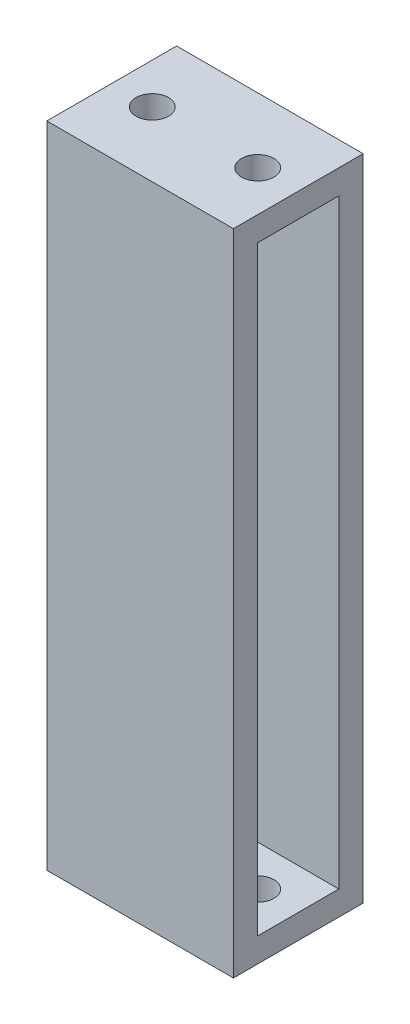
ISO-10303-21;
HEADER;
FILE_DESCRIPTION(('STEP AP214'),'2;1');
FILE_NAME('part.step','',(''),(''),'','','');
FILE_SCHEMA(('AUTOMOTIVE_DESIGN { 1 0 10303 214 1 1 1 1 }'));
ENDSEC;
DATA;
#1=APPLICATION_CONTEXT('core data for automotive mechanical design processes');
#2=APPLICATION_PROTOCOL_DEFINITION('international standard','automotive_design',2000,#1);
#3=PRODUCT_CONTEXT('',#1,'mechanical');
#4=PRODUCT('Part','Part','',(#3));
#5=PRODUCT_RELATED_PRODUCT_CATEGORY('part','',(#4));
#6=PRODUCT_DEFINITION_FORMATION('','',#4);
#7=PRODUCT_DEFINITION_CONTEXT('part definition',#1,'design');
#8=PRODUCT_DEFINITION('design','',#6,#7);
#9=PRODUCT_DEFINITION_SHAPE('','',#8);
#10=(LENGTH_UNIT() NAMED_UNIT(*) SI_UNIT(.MILLI.,.METRE.));
#11=(NAMED_UNIT(*) PLANE_ANGLE_UNIT() SI_UNIT($,.RADIAN.));
#12=(NAMED_UNIT(*) SI_UNIT($,.STERADIAN.) SOLID_ANGLE_UNIT());
#13=UNCERTAINTY_MEASURE_WITH_UNIT(LENGTH_MEASURE(1.E-05),#10,'distance_accuracy_value','');
#14=(GEOMETRIC_REPRESENTATION_CONTEXT(3) GLOBAL_UNCERTAINTY_ASSIGNED_CONTEXT((#13)) GLOBAL_UNIT_ASSIGNED_CONTEXT((#10,
#11,#12)) REPRESENTATION_CONTEXT('',''));
#15=CARTESIAN_POINT('',(0.,0.,0.));
#16=DIRECTION('',(0.,0.,1.));
#17=DIRECTION('',(1.,0.,0.));
#18=AXIS2_PLACEMENT_3D('',#15,#16,#17);
#19=CARTESIAN_POINT('',(1.5,80.,-5.));
#20=DIRECTION('',(-1.,0.,0.));
#21=DIRECTION('',(0.,0.,1.));
#22=AXIS2_PLACEMENT_3D('',#19,#20,#21);
#23=PLANE('',#22);
#24=DIRECTION('',(0.,0.,-1.));
#25=VECTOR('',#24,1.);
#26=CARTESIAN_POINT('',(1.5,77.,-5.));
#27=LINE('',#26,#25);
#28=CARTESIAN_POINT('',(1.49999999999999,77.,5.));
#29=VERTEX_POINT('',#28);
#30=CARTESIAN_POINT('',(1.5,77.,-5.));
#31=VERTEX_POINT('',#30);
#32=EDGE_CURVE('E228',#29,#31,#27,.T.);
#33=ORIENTED_EDGE('',*,*,#32,.F.);
#34=DIRECTION('',(0.,-1.,0.));
#35=VECTOR('',#34,1.);
#36=CARTESIAN_POINT('',(1.49999999999999,80.,5.));
#37=LINE('',#36,#35);
#38=CARTESIAN_POINT('',(1.49999999999999,3.,5.));
#39=VERTEX_POINT('',#38);
#40=EDGE_CURVE('E144',#29,#39,#37,.T.);
#41=ORIENTED_EDGE('',*,*,#40,.T.);
#42=DIRECTION('',(0.,0.,1.));
#43=VECTOR('',#42,1.);
#44=CARTESIAN_POINT('',(1.5,3.,-5.));
#45=LINE('',#44,#43);
#46=CARTESIAN_POINT('',(1.5,3.,-5.));
#47=VERTEX_POINT('',#46);
#48=EDGE_CURVE('E250',#47,#39,#45,.T.);
#49=ORIENTED_EDGE('',*,*,#48,.F.);
#50=DIRECTION('',(0.,-1.,0.));
#51=VECTOR('',#50,1.);
#52=CARTESIAN_POINT('',(1.5,80.,-5.));
#53=LINE('',#52,#51);
#54=EDGE_CURVE('E11',#31,#47,#53,.T.);
#55=ORIENTED_EDGE('',*,*,#54,.F.);
#56=EDGE_LOOP('',(#33,#41,#49,#55));
#57=FACE_BOUND('',#56,.T.);
#58=ADVANCED_FACE('F39',(#57),#23,.F.);
#59=CARTESIAN_POINT('',(1.5,80.,-5.));
#60=DIRECTION('',(0.,0.,-1.));
#61=DIRECTION('',(-1.,0.,0.));
#62=AXIS2_PLACEMENT_3D('',#59,#60,#61);
#63=PLANE('',#62);
#64=DIRECTION('',(-1.,0.,0.));
#65=VECTOR('',#64,1.);
#66=CARTESIAN_POINT('',(11.5,77.,-5.));
#67=LINE('',#66,#65);
#68=CARTESIAN_POINT('',(11.5,77.,-5.));
#69=VERTEX_POINT('',#68);
#70=EDGE_CURVE('E133',#69,#31,#67,.T.);
#71=ORIENTED_EDGE('',*,*,#70,.T.);
#72=ORIENTED_EDGE('',*,*,#54,.T.);
#73=DIRECTION('',(-1.,0.,0.));
#74=VECTOR('',#73,1.);
#75=CARTESIAN_POINT('',(11.5,3.,-5.));
#76=LINE('',#75,#74);
#77=CARTESIAN_POINT('',(11.5,3.,-5.));
#78=VERTEX_POINT('',#77);
#79=EDGE_CURVE('E242',#78,#47,#76,.T.);
#80=ORIENTED_EDGE('',*,*,#79,.F.);
#81=DIRECTION('',(0.,-1.,0.));
#82=VECTOR('',#81,1.);
#83=CARTESIAN_POINT('',(11.5,80.,-5.));
#84=LINE('',#83,#82);
#85=EDGE_CURVE('E48',#69,#78,#84,.T.);
#86=ORIENTED_EDGE('',*,*,#85,.F.);
#87=EDGE_LOOP('',(#71,#72,#80,#86));
#88=FACE_BOUND('',#87,.T.);
#89=ADVANCED_FACE('F311',(#88),#63,.F.);
#90=CARTESIAN_POINT('',(-1.5,80.,-5.));
#91=DIRECTION('',(0.,0.,-1.));
#92=DIRECTION('',(-1.,0.,0.));
#93=AXIS2_PLACEMENT_3D('',#90,#91,#92);
#94=PLANE('',#93);
#95=CARTESIAN_POINT('',(-1.5,77.,-5.));
#96=VERTEX_POINT('',#95);
#97=CARTESIAN_POINT('',(-11.5,77.,-5.));
#98=VERTEX_POINT('',#97);
#99=EDGE_CURVE('E136',#96,#98,#67,.T.);
#100=ORIENTED_EDGE('',*,*,#99,.T.);
#101=DIRECTION('',(0.,-1.,0.));
#102=VECTOR('',#101,1.);
#103=CARTESIAN_POINT('',(-11.5,80.,-5.));
#104=LINE('',#103,#102);
#105=CARTESIAN_POINT('',(-11.5,3.,-5.));
#106=VERTEX_POINT('',#105);
#107=EDGE_CURVE('E178',#98,#106,#104,.T.);
#108=ORIENTED_EDGE('',*,*,#107,.T.);
#109=CARTESIAN_POINT('',(-1.5,3.,-5.));
#110=VERTEX_POINT('',#109);
#111=EDGE_CURVE('E241',#110,#106,#76,.T.);
#112=ORIENTED_EDGE('',*,*,#111,.F.);
#113=DIRECTION('',(0.,-1.,0.));
#114=VECTOR('',#113,1.);
#115=CARTESIAN_POINT('',(-1.5,80.,-5.));
#116=LINE('',#115,#114);
#117=EDGE_CURVE('E175',#96,#110,#116,.T.);
#118=ORIENTED_EDGE('',*,*,#117,.F.);
#119=EDGE_LOOP('',(#100,#108,#112,#118));
#120=FACE_BOUND('',#119,.T.);
#121=ADVANCED_FACE('F316',(#120),#94,.F.);
#122=CARTESIAN_POINT('',(-1.5,80.,-5.));
#123=DIRECTION('',(1.,0.,0.));
#124=DIRECTION('',(0.,0.,-1.));
#125=AXIS2_PLACEMENT_3D('',#122,#123,#124);
#126=PLANE('',#125);
#127=DIRECTION('',(0.,0.,1.));
#128=VECTOR('',#127,1.);
#129=CARTESIAN_POINT('',(-1.5,77.,-5.));
#130=LINE('',#129,#128);
#131=CARTESIAN_POINT('',(-1.50000000000001,77.,5.));
#132=VERTEX_POINT('',#131);
#133=EDGE_CURVE('E146',#96,#132,#130,.T.);
#134=ORIENTED_EDGE('',*,*,#133,.F.);
#135=ORIENTED_EDGE('',*,*,#117,.T.);
#136=DIRECTION('',(0.,0.,-1.));
#137=VECTOR('',#136,1.);
#138=CARTESIAN_POINT('',(-1.5,3.,-5.));
#139=LINE('',#138,#137);
#140=CARTESIAN_POINT('',(-1.50000000000001,3.,5.));
#141=VERTEX_POINT('',#140);
#142=EDGE_CURVE('E246',#141,#110,#139,.T.);
#143=ORIENTED_EDGE('',*,*,#142,.F.);
#144=DIRECTION('',(0.,-1.,0.));
#145=VECTOR('',#144,1.);
#146=CARTESIAN_POINT('',(-1.50000000000001,80.,5.));
#147=LINE('',#146,#145);
#148=EDGE_CURVE('E172',#132,#141,#147,.T.);
#149=ORIENTED_EDGE('',*,*,#148,.F.);
#150=EDGE_LOOP('',(#134,#135,#143,#149));
#151=FACE_BOUND('',#150,.T.);
#152=ADVANCED_FACE('F376',(#151),#126,.F.);
#153=CARTESIAN_POINT('',(-1.50000000000001,80.,5.));
#154=DIRECTION('',(0.,0.,1.));
#155=DIRECTION('',(1.,0.,0.));
#156=AXIS2_PLACEMENT_3D('',#153,#154,#155);
#157=PLANE('',#156);
#158=DIRECTION('',(-1.,0.,0.));
#159=VECTOR('',#158,1.);
#160=CARTESIAN_POINT('',(11.5,77.,5.));
#161=LINE('',#160,#159);
#162=CARTESIAN_POINT('',(-11.5,77.,5.));
#163=VERTEX_POINT('',#162);
#164=EDGE_CURVE('E147',#132,#163,#161,.T.);
#165=ORIENTED_EDGE('',*,*,#164,.F.);
#166=ORIENTED_EDGE('',*,*,#148,.T.);
#167=DIRECTION('',(-1.,0.,0.));
#168=VECTOR('',#167,1.);
#169=CARTESIAN_POINT('',(11.5,3.,5.));
#170=LINE('',#169,#168);
#171=CARTESIAN_POINT('',(-11.5,3.,5.));
#172=VERTEX_POINT('',#171);
#173=EDGE_CURVE('E234',#141,#172,#170,.T.);
#174=ORIENTED_EDGE('',*,*,#173,.T.);
#175=DIRECTION('',(0.,-1.,0.));
#176=VECTOR('',#175,1.);
#177=CARTESIAN_POINT('',(-11.5,80.,5.));
#178=LINE('',#177,#176);
#179=EDGE_CURVE('E169',#163,#172,#178,.T.);
#180=ORIENTED_EDGE('',*,*,#179,.F.);
#181=EDGE_LOOP('',(#165,#166,#174,#180));
#182=FACE_BOUND('',#181,.T.);
#183=ADVANCED_FACE('F372',(#182),#157,.F.);
#184=CARTESIAN_POINT('',(1.49999999999999,80.,5.));
#185=DIRECTION('',(0.,0.,1.));
#186=DIRECTION('',(1.,0.,0.));
#187=AXIS2_PLACEMENT_3D('',#184,#185,#186);
#188=PLANE('',#187);
#189=CARTESIAN_POINT('',(11.5,77.,5.));
#190=VERTEX_POINT('',#189);
#191=EDGE_CURVE('E131',#190,#29,#161,.T.);
#192=ORIENTED_EDGE('',*,*,#191,.F.);
#193=DIRECTION('',(0.,-1.,0.));
#194=VECTOR('',#193,1.);
#195=CARTESIAN_POINT('',(11.5,80.,5.));
#196=LINE('',#195,#194);
#197=CARTESIAN_POINT('',(11.5,3.,5.));
#198=VERTEX_POINT('',#197);
#199=EDGE_CURVE('E143',#190,#198,#196,.T.);
#200=ORIENTED_EDGE('',*,*,#199,.T.);
#201=EDGE_CURVE('E238',#198,#39,#170,.T.);
#202=ORIENTED_EDGE('',*,*,#201,.T.);
#203=ORIENTED_EDGE('',*,*,#40,.F.);
#204=EDGE_LOOP('',(#192,#200,#202,#203));
#205=FACE_BOUND('',#204,.T.);
#206=ADVANCED_FACE('F141',(#205),#188,.F.);
#207=CARTESIAN_POINT('',(-11.5,80.,-8.));
#208=DIRECTION('',(0.,0.,1.));
#209=DIRECTION('',(1.,0.,0.));
#210=AXIS2_PLACEMENT_3D('',#207,#208,#209);
#211=PLANE('',#210);
#212=DIRECTION('',(-1.,0.,0.));
#213=VECTOR('',#212,1.);
#214=CARTESIAN_POINT('',(-11.5,0.,-8.));
#215=LINE('',#214,#213);
#216=CARTESIAN_POINT('',(11.5,0.,-8.));
#217=VERTEX_POINT('',#216);
#218=CARTESIAN_POINT('',(-11.5,0.,-8.));
#219=VERTEX_POINT('',#218);
#220=EDGE_CURVE('E254',#217,#219,#215,.T.);
#221=ORIENTED_EDGE('',*,*,#220,.T.);
#222=DIRECTION('',(0.,-1.,0.));
#223=VECTOR('',#222,1.);
#224=CARTESIAN_POINT('',(-11.5,80.,-8.));
#225=LINE('',#224,#223);
#226=CARTESIAN_POINT('',(-11.5,80.,-8.));
#227=VERTEX_POINT('',#226);
#228=EDGE_CURVE('E181',#227,#219,#225,.T.);
#229=ORIENTED_EDGE('',*,*,#228,.F.);
#230=DIRECTION('',(-1.,0.,0.));
#231=VECTOR('',#230,1.);
#232=CARTESIAN_POINT('',(-11.5,80.,-8.));
#233=LINE('',#232,#231);
#234=CARTESIAN_POINT('',(11.5,80.,-8.));
#235=VERTEX_POINT('',#234);
#236=EDGE_CURVE('E258',#235,#227,#233,.T.);
#237=ORIENTED_EDGE('',*,*,#236,.F.);
#238=DIRECTION('',(0.,-1.,0.));
#239=VECTOR('',#238,1.);
#240=CARTESIAN_POINT('',(11.5,80.,-8.));
#241=LINE('',#240,#239);
#242=EDGE_CURVE('E185',#235,#217,#241,.T.);
#243=ORIENTED_EDGE('',*,*,#242,.T.);
#244=EDGE_LOOP('',(#221,#229,#237,#243));
#245=FACE_BOUND('',#244,.T.);
#246=ADVANCED_FACE('F285',(#245),#211,.F.);
#247=CARTESIAN_POINT('',(-11.5,80.,5.));
#248=DIRECTION('',(1.,0.,0.));
#249=DIRECTION('',(0.,0.,-1.));
#250=AXIS2_PLACEMENT_3D('',#247,#248,#249);
#251=PLANE('',#250);
#252=DIRECTION('',(0.,0.,-1.));
#253=VECTOR('',#252,1.);
#254=CARTESIAN_POINT('',(-11.5,77.,5.));
#255=LINE('',#254,#253);
#256=EDGE_CURVE('E137',#163,#98,#255,.T.);
#257=ORIENTED_EDGE('',*,*,#256,.F.);
#258=ORIENTED_EDGE('',*,*,#179,.T.);
#259=DIRECTION('',(0.,0.,1.));
#260=VECTOR('',#259,1.);
#261=CARTESIAN_POINT('',(-11.5,3.,5.));
#262=LINE('',#261,#260);
#263=EDGE_CURVE('E231',#106,#172,#262,.T.);
#264=ORIENTED_EDGE('',*,*,#263,.F.);
#265=ORIENTED_EDGE('',*,*,#107,.F.);
#266=EDGE_LOOP('',(#257,#258,#264,#265));
#267=FACE_BOUND('',#266,.T.);
#268=DIRECTION('',(0.,0.,1.));
#269=VECTOR('',#268,1.);
#270=CARTESIAN_POINT('',(-11.5,0.,5.));
#271=LINE('',#270,#269);
#272=CARTESIAN_POINT('',(-11.5,0.,8.));
#273=VERTEX_POINT('',#272);
#274=EDGE_CURVE('E271',#219,#273,#271,.T.);
#275=ORIENTED_EDGE('',*,*,#274,.T.);
#276=DIRECTION('',(0.,-1.,0.));
#277=VECTOR('',#276,1.);
#278=CARTESIAN_POINT('',(-11.5,80.,8.));
#279=LINE('',#278,#277);
#280=CARTESIAN_POINT('',(-11.5,80.,8.));
#281=VERTEX_POINT('',#280);
#282=EDGE_CURVE('E160',#281,#273,#279,.T.);
#283=ORIENTED_EDGE('',*,*,#282,.F.);
#284=DIRECTION('',(0.,0.,1.));
#285=VECTOR('',#284,1.);
#286=CARTESIAN_POINT('',(-11.5,80.,-5.));
#287=LINE('',#286,#285);
#288=EDGE_CURVE('E262',#227,#281,#287,.T.);
#289=ORIENTED_EDGE('',*,*,#288,.F.);
#290=ORIENTED_EDGE('',*,*,#228,.T.);
#291=EDGE_LOOP('',(#275,#283,#289,#290));
#292=FACE_BOUND('',#291,.T.);
#293=ADVANCED_FACE('F290',(#267,#292),#251,.F.);
#294=CARTESIAN_POINT('',(-11.5,80.,8.));
#295=DIRECTION('',(0.,0.,-1.));
#296=DIRECTION('',(-1.,0.,0.));
#297=AXIS2_PLACEMENT_3D('',#294,#295,#296);
#298=PLANE('',#297);
#299=DIRECTION('',(1.,0.,0.));
#300=VECTOR('',#299,1.);
#301=CARTESIAN_POINT('',(-11.5,0.,8.));
#302=LINE('',#301,#300);
#303=CARTESIAN_POINT('',(11.5,0.,8.));
#304=VERTEX_POINT('',#303);
#305=EDGE_CURVE('E274',#273,#304,#302,.T.);
#306=ORIENTED_EDGE('',*,*,#305,.T.);
#307=DIRECTION('',(0.,-1.,0.));
#308=VECTOR('',#307,1.);
#309=CARTESIAN_POINT('',(11.5,80.,8.));
#310=LINE('',#309,#308);
#311=CARTESIAN_POINT('',(11.5,80.,8.));
#312=VERTEX_POINT('',#311);
#313=EDGE_CURVE('E155',#312,#304,#310,.T.);
#314=ORIENTED_EDGE('',*,*,#313,.F.);
#315=DIRECTION('',(1.,0.,0.));
#316=VECTOR('',#315,1.);
#317=CARTESIAN_POINT('',(-11.5,80.,8.));
#318=LINE('',#317,#316);
#319=EDGE_CURVE('E162',#281,#312,#318,.T.);
#320=ORIENTED_EDGE('',*,*,#319,.F.);
#321=ORIENTED_EDGE('',*,*,#282,.T.);
#322=EDGE_LOOP('',(#306,#314,#320,#321));
#323=FACE_BOUND('',#322,.T.);
#324=ADVANCED_FACE('F294',(#323),#298,.F.);
#325=CARTESIAN_POINT('',(11.5,80.,5.));
#326=DIRECTION('',(-1.,0.,0.));
#327=DIRECTION('',(0.,0.,1.));
#328=AXIS2_PLACEMENT_3D('',#325,#326,#327);
#329=PLANE('',#328);
#330=ORIENTED_EDGE('',*,*,#199,.F.);
#331=DIRECTION('',(0.,0.,-1.));
#332=VECTOR('',#331,1.);
#333=CARTESIAN_POINT('',(11.5,77.,5.));
#334=LINE('',#333,#332);
#335=EDGE_CURVE('E128',#190,#69,#334,.T.);
#336=ORIENTED_EDGE('',*,*,#335,.T.);
#337=ORIENTED_EDGE('',*,*,#85,.T.);
#338=DIRECTION('',(0.,0.,1.));
#339=VECTOR('',#338,1.);
#340=CARTESIAN_POINT('',(11.5,3.,5.));
#341=LINE('',#340,#339);
#342=EDGE_CURVE('E152',#78,#198,#341,.T.);
#343=ORIENTED_EDGE('',*,*,#342,.T.);
#344=EDGE_LOOP('',(#330,#336,#337,#343));
#345=FACE_BOUND('',#344,.T.);
#346=DIRECTION('',(0.,0.,-1.));
#347=VECTOR('',#346,1.);
#348=CARTESIAN_POINT('',(11.5,0.,5.));
#349=LINE('',#348,#347);
#350=EDGE_CURVE('E259',#304,#217,#349,.T.);
#351=ORIENTED_EDGE('',*,*,#350,.T.);
#352=ORIENTED_EDGE('',*,*,#242,.F.);
#353=DIRECTION('',(0.,0.,-1.));
#354=VECTOR('',#353,1.);
#355=CARTESIAN_POINT('',(11.5,80.,-5.));
#356=LINE('',#355,#354);
#357=EDGE_CURVE('E255',#312,#235,#356,.T.);
#358=ORIENTED_EDGE('',*,*,#357,.F.);
#359=ORIENTED_EDGE('',*,*,#313,.T.);
#360=EDGE_LOOP('',(#351,#352,#358,#359));
#361=FACE_BOUND('',#360,.T.);
#362=ADVANCED_FACE('F149',(#345,#361),#329,.F.);
#363=CARTESIAN_POINT('',(0.,80.,0.));
#364=DIRECTION('',(0.,1.,0.));
#365=DIRECTION('',(0.,0.,1.));
#366=AXIS2_PLACEMENT_3D('',#363,#364,#365);
#367=PLANE('',#366);
#368=CARTESIAN_POINT('',(6.5,80.,0.));
#369=DIRECTION('',(0.,1.,0.));
#370=DIRECTION('',(0.,0.,1.));
#371=AXIS2_PLACEMENT_3D('',#368,#369,#370);
#372=CIRCLE('',#371,2.);
#373=CARTESIAN_POINT('',(6.5,80.,2.));
#374=VERTEX_POINT('',#373);
#375=EDGE_CURVE('E194',#374,#374,#372,.T.);
#376=ORIENTED_EDGE('',*,*,#375,.F.);
#377=EDGE_LOOP('',(#376));
#378=FACE_BOUND('',#377,.T.);
#379=CARTESIAN_POINT('',(-6.50000000000001,80.,0.));
#380=DIRECTION('',(0.,1.,0.));
#381=DIRECTION('',(0.,0.,-1.));
#382=AXIS2_PLACEMENT_3D('',#379,#380,#381);
#383=CIRCLE('',#382,2.);
#384=CARTESIAN_POINT('',(-6.50000000000001,80.,-2.));
#385=VERTEX_POINT('',#384);
#386=EDGE_CURVE('E203',#385,#385,#383,.T.);
#387=ORIENTED_EDGE('',*,*,#386,.F.);
#388=EDGE_LOOP('',(#387));
#389=FACE_BOUND('',#388,.T.);
#390=ORIENTED_EDGE('',*,*,#319,.T.);
#391=ORIENTED_EDGE('',*,*,#357,.T.);
#392=ORIENTED_EDGE('',*,*,#236,.T.);
#393=ORIENTED_EDGE('',*,*,#288,.T.);
#394=EDGE_LOOP('',(#390,#391,#392,#393));
#395=FACE_BOUND('',#394,.T.);
#396=ADVANCED_FACE('F296',(#378,#389,#395),#367,.T.);
#397=CARTESIAN_POINT('',(0.,0.,0.));
#398=DIRECTION('',(0.,1.,0.));
#399=DIRECTION('',(0.,0.,1.));
#400=AXIS2_PLACEMENT_3D('',#397,#398,#399);
#401=PLANE('',#400);
#402=CARTESIAN_POINT('',(6.5,0.,0.));
#403=DIRECTION('',(0.,1.,0.));
#404=DIRECTION('',(0.,0.,1.));
#405=AXIS2_PLACEMENT_3D('',#402,#403,#404);
#406=CIRCLE('',#405,2.);
#407=CARTESIAN_POINT('',(6.5,0.,2.));
#408=VERTEX_POINT('',#407);
#409=EDGE_CURVE('E218',#408,#408,#406,.T.);
#410=ORIENTED_EDGE('',*,*,#409,.T.);
#411=EDGE_LOOP('',(#410));
#412=FACE_BOUND('',#411,.T.);
#413=CARTESIAN_POINT('',(-6.50000000000001,0.,0.));
#414=DIRECTION('',(0.,1.,0.));
#415=DIRECTION('',(0.,0.,1.));
#416=AXIS2_PLACEMENT_3D('',#413,#414,#415);
#417=CIRCLE('',#416,2.);
#418=CARTESIAN_POINT('',(-6.50000000000001,0.,1.99999999999999));
#419=VERTEX_POINT('',#418);
#420=EDGE_CURVE('E200',#419,#419,#417,.T.);
#421=ORIENTED_EDGE('',*,*,#420,.T.);
#422=EDGE_LOOP('',(#421));
#423=FACE_BOUND('',#422,.T.);
#424=ORIENTED_EDGE('',*,*,#220,.F.);
#425=ORIENTED_EDGE('',*,*,#350,.F.);
#426=ORIENTED_EDGE('',*,*,#305,.F.);
#427=ORIENTED_EDGE('',*,*,#274,.F.);
#428=EDGE_LOOP('',(#424,#425,#426,#427));
#429=FACE_BOUND('',#428,.T.);
#430=ADVANCED_FACE('F287',(#412,#423,#429),#401,.F.);
#431=CARTESIAN_POINT('',(11.5,3.,5.));
#432=DIRECTION('',(0.,-1.,0.));
#433=DIRECTION('',(0.,0.,-1.));
#434=AXIS2_PLACEMENT_3D('',#431,#432,#433);
#435=PLANE('',#434);
#436=CARTESIAN_POINT('',(6.5,3.,0.));
#437=DIRECTION('',(0.,-1.,0.));
#438=DIRECTION('',(0.,0.,-1.));
#439=AXIS2_PLACEMENT_3D('',#436,#437,#438);
#440=CIRCLE('',#439,2.);
#441=CARTESIAN_POINT('',(6.5,3.,-2.));
#442=VERTEX_POINT('',#441);
#443=EDGE_CURVE('E214',#442,#442,#440,.T.);
#444=ORIENTED_EDGE('',*,*,#443,.T.);
#445=EDGE_LOOP('',(#444));
#446=FACE_BOUND('',#445,.T.);
#447=ORIENTED_EDGE('',*,*,#79,.T.);
#448=ORIENTED_EDGE('',*,*,#48,.T.);
#449=ORIENTED_EDGE('',*,*,#201,.F.);
#450=ORIENTED_EDGE('',*,*,#342,.F.);
#451=EDGE_LOOP('',(#447,#448,#449,#450));
#452=FACE_BOUND('',#451,.T.);
#453=ADVANCED_FACE('F304',(#446,#452),#435,.F.);
#454=CARTESIAN_POINT('',(-6.50000000000001,3.,0.));
#455=DIRECTION('',(0.,-1.,0.));
#456=DIRECTION('',(0.,0.,-1.));
#457=AXIS2_PLACEMENT_3D('',#454,#455,#456);
#458=CIRCLE('',#457,2.);
#459=CARTESIAN_POINT('',(-6.50000000000001,3.,-2.));
#460=VERTEX_POINT('',#459);
#461=EDGE_CURVE('E193',#460,#460,#458,.T.);
#462=ORIENTED_EDGE('',*,*,#461,.T.);
#463=EDGE_LOOP('',(#462));
#464=FACE_BOUND('',#463,.T.);
#465=ORIENTED_EDGE('',*,*,#173,.F.);
#466=ORIENTED_EDGE('',*,*,#142,.T.);
#467=ORIENTED_EDGE('',*,*,#111,.T.);
#468=ORIENTED_EDGE('',*,*,#263,.T.);
#469=EDGE_LOOP('',(#465,#466,#467,#468));
#470=FACE_BOUND('',#469,.T.);
#471=ADVANCED_FACE('F319',(#464,#470),#435,.F.);
#472=CARTESIAN_POINT('',(11.5,77.,5.));
#473=DIRECTION('',(0.,1.,0.));
#474=DIRECTION('',(0.,0.,1.));
#475=AXIS2_PLACEMENT_3D('',#472,#473,#474);
#476=PLANE('',#475);
#477=CARTESIAN_POINT('',(6.5,77.,0.));
#478=DIRECTION('',(0.,1.,0.));
#479=DIRECTION('',(0.,0.,1.));
#480=AXIS2_PLACEMENT_3D('',#477,#478,#479);
#481=CIRCLE('',#480,2.);
#482=CARTESIAN_POINT('',(6.5,77.,2.));
#483=VERTEX_POINT('',#482);
#484=EDGE_CURVE('E42',#483,#483,#481,.T.);
#485=ORIENTED_EDGE('',*,*,#484,.T.);
#486=EDGE_LOOP('',(#485));
#487=FACE_BOUND('',#486,.T.);
#488=ORIENTED_EDGE('',*,*,#191,.T.);
#489=ORIENTED_EDGE('',*,*,#32,.T.);
#490=ORIENTED_EDGE('',*,*,#70,.F.);
#491=ORIENTED_EDGE('',*,*,#335,.F.);
#492=EDGE_LOOP('',(#488,#489,#490,#491));
#493=FACE_BOUND('',#492,.T.);
#494=ADVANCED_FACE('F130',(#487,#493),#476,.F.);
#495=CARTESIAN_POINT('',(-6.50000000000001,77.,0.));
#496=DIRECTION('',(0.,1.,0.));
#497=DIRECTION('',(0.,0.,1.));
#498=AXIS2_PLACEMENT_3D('',#495,#496,#497);
#499=CIRCLE('',#498,2.);
#500=CARTESIAN_POINT('',(-6.50000000000001,77.,1.99999999999999));
#501=VERTEX_POINT('',#500);
#502=EDGE_CURVE('E190',#501,#501,#499,.T.);
#503=ORIENTED_EDGE('',*,*,#502,.T.);
#504=EDGE_LOOP('',(#503));
#505=FACE_BOUND('',#504,.T.);
#506=ORIENTED_EDGE('',*,*,#99,.F.);
#507=ORIENTED_EDGE('',*,*,#133,.T.);
#508=ORIENTED_EDGE('',*,*,#164,.T.);
#509=ORIENTED_EDGE('',*,*,#256,.T.);
#510=EDGE_LOOP('',(#506,#507,#508,#509));
#511=FACE_BOUND('',#510,.T.);
#512=ADVANCED_FACE('F328',(#505,#511),#476,.F.);
#513=CARTESIAN_POINT('',(-6.50000000000001,-1.2E-05,0.));
#514=DIRECTION('',(0.,1.,0.));
#515=DIRECTION('',(0.,0.,1.));
#516=AXIS2_PLACEMENT_3D('',#513,#514,#515);
#517=CYLINDRICAL_SURFACE('',#516,2.);
#518=ORIENTED_EDGE('',*,*,#386,.T.);
#519=EDGE_LOOP('',(#518));
#520=FACE_BOUND('',#519,.T.);
#521=ORIENTED_EDGE('',*,*,#502,.F.);
#522=EDGE_LOOP('',(#521));
#523=FACE_BOUND('',#522,.T.);
#524=ADVANCED_FACE('F336',(#520,#523),#517,.F.);
#525=CARTESIAN_POINT('',(6.5,-1.2E-05,0.));
#526=DIRECTION('',(0.,1.,0.));
#527=DIRECTION('',(0.,0.,1.));
#528=AXIS2_PLACEMENT_3D('',#525,#526,#527);
#529=CYLINDRICAL_SURFACE('',#528,2.);
#530=ORIENTED_EDGE('',*,*,#375,.T.);
#531=EDGE_LOOP('',(#530));
#532=FACE_BOUND('',#531,.T.);
#533=ORIENTED_EDGE('',*,*,#484,.F.);
#534=EDGE_LOOP('',(#533));
#535=FACE_BOUND('',#534,.T.);
#536=ADVANCED_FACE('F334',(#532,#535),#529,.F.);
#537=ORIENTED_EDGE('',*,*,#461,.F.);
#538=EDGE_LOOP('',(#537));
#539=FACE_BOUND('',#538,.T.);
#540=ORIENTED_EDGE('',*,*,#420,.F.);
#541=EDGE_LOOP('',(#540));
#542=FACE_BOUND('',#541,.T.);
#543=ADVANCED_FACE('F330',(#539,#542),#517,.F.);
#544=ORIENTED_EDGE('',*,*,#443,.F.);
#545=EDGE_LOOP('',(#544));
#546=FACE_BOUND('',#545,.T.);
#547=ORIENTED_EDGE('',*,*,#409,.F.);
#548=EDGE_LOOP('',(#547));
#549=FACE_BOUND('',#548,.T.);
#550=ADVANCED_FACE('F333',(#546,#549),#529,.F.);
#551=CLOSED_SHELL('',(#58,#89,#121,#152,#183,#206,#246,#293,#324,#362,#396,#430,#453,#471,#494,
#512,#524,#536,#543,#550));
#552=MANIFOLD_SOLID_BREP('B2',#551);
#553=ADVANCED_BREP_SHAPE_REPRESENTATION('',(#18,#552),#14);
#554=SHAPE_DEFINITION_REPRESENTATION(#9,#553);
ENDSEC;
END-ISO-10303-21;
